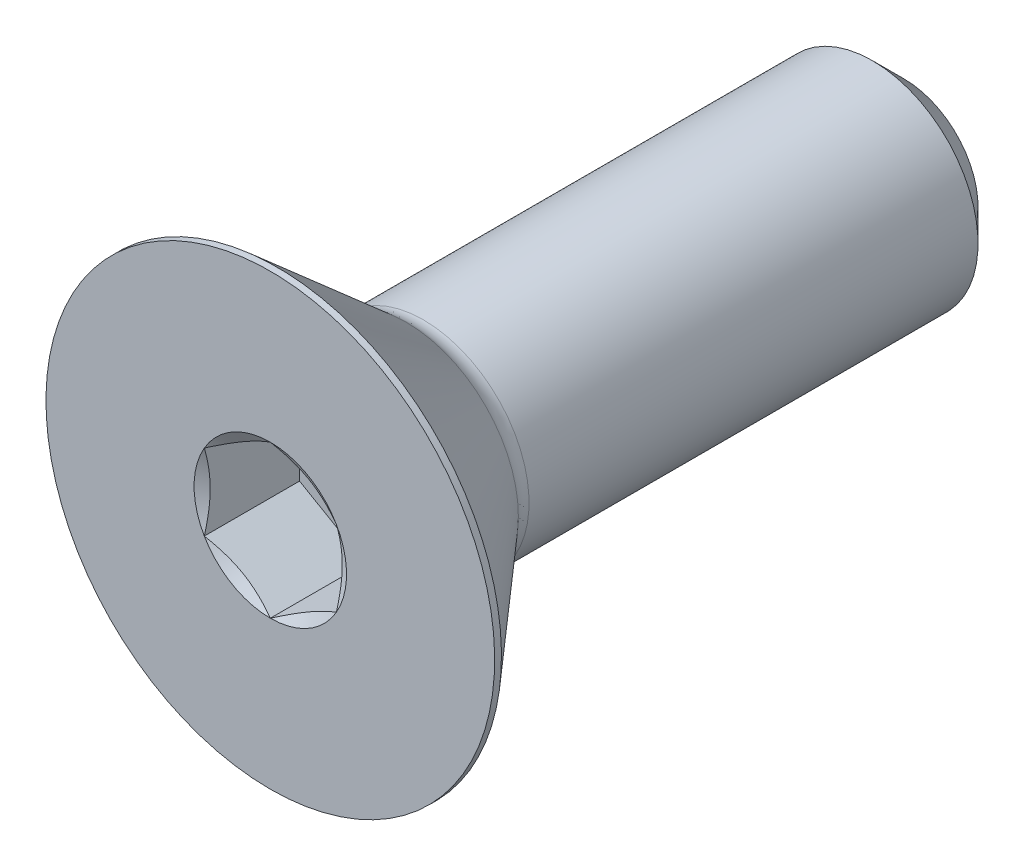
ISO-10303-21;
HEADER;
FILE_DESCRIPTION(('STEP AP214'),'2;1');
FILE_NAME('part.step','',(''),(''),'','','');
FILE_SCHEMA(('AUTOMOTIVE_DESIGN { 1 0 10303 214 1 1 1 1 }'));
ENDSEC;
DATA;
#1=APPLICATION_CONTEXT('core data for automotive mechanical design processes');
#2=APPLICATION_PROTOCOL_DEFINITION('international standard','automotive_design',2000,#1);
#3=PRODUCT_CONTEXT('',#1,'mechanical');
#4=PRODUCT('Part','Part','',(#3));
#5=PRODUCT_RELATED_PRODUCT_CATEGORY('part','',(#4));
#6=PRODUCT_DEFINITION_FORMATION('','',#4);
#7=PRODUCT_DEFINITION_CONTEXT('part definition',#1,'design');
#8=PRODUCT_DEFINITION('design','',#6,#7);
#9=PRODUCT_DEFINITION_SHAPE('','',#8);
#10=(LENGTH_UNIT() NAMED_UNIT(*) SI_UNIT(.MILLI.,.METRE.));
#11=(NAMED_UNIT(*) PLANE_ANGLE_UNIT() SI_UNIT($,.RADIAN.));
#12=(NAMED_UNIT(*) SI_UNIT($,.STERADIAN.) SOLID_ANGLE_UNIT());
#13=UNCERTAINTY_MEASURE_WITH_UNIT(LENGTH_MEASURE(1.E-05),#10,'distance_accuracy_value','');
#14=(GEOMETRIC_REPRESENTATION_CONTEXT(3) GLOBAL_UNCERTAINTY_ASSIGNED_CONTEXT((#13)) GLOBAL_UNIT_ASSIGNED_CONTEXT((#10,
#11,#12)) REPRESENTATION_CONTEXT('',''));
#15=CARTESIAN_POINT('',(0.,0.,0.));
#16=DIRECTION('',(0.,0.,1.));
#17=DIRECTION('',(1.,0.,0.));
#18=AXIS2_PLACEMENT_3D('',#15,#16,#17);
#19=CARTESIAN_POINT('',(0.,0.,-19.05));
#20=DIRECTION('',(0.,0.,-1.));
#21=DIRECTION('',(0.,1.,0.));
#22=AXIS2_PLACEMENT_3D('',#19,#20,#21);
#23=CYLINDRICAL_SURFACE('',#22,3.175);
#24=CARTESIAN_POINT('',(0.,0.,-18.0975));
#25=DIRECTION('',(0.,0.,-1.));
#26=DIRECTION('',(0.,1.,0.));
#27=AXIS2_PLACEMENT_3D('',#24,#25,#26);
#28=CIRCLE('',#27,3.175);
#29=CARTESIAN_POINT('',(0.,3.175,-18.0975));
#30=VERTEX_POINT('',#29);
#31=EDGE_CURVE('E52',#30,#30,#28,.F.);
#32=ORIENTED_EDGE('',*,*,#31,.T.);
#33=EDGE_LOOP('',(#32));
#34=FACE_BOUND('',#33,.T.);
#35=CARTESIAN_POINT('',(0.,0.,-4.60180899712602));
#36=DIRECTION('',(0.,0.,1.));
#37=DIRECTION('',(0.,-1.,0.));
#38=AXIS2_PLACEMENT_3D('',#35,#36,#37);
#39=CIRCLE('',#38,3.175);
#40=CARTESIAN_POINT('',(0.,-3.175,-4.60180899712602));
#41=VERTEX_POINT('',#40);
#42=EDGE_CURVE('E215',#41,#41,#39,.T.);
#43=ORIENTED_EDGE('',*,*,#42,.F.);
#44=EDGE_LOOP('',(#43));
#45=FACE_BOUND('',#44,.T.);
#46=ADVANCED_FACE('F38',(#34,#45),#23,.T.);
#47=CARTESIAN_POINT('',(0.,-3.175,-19.05));
#48=DIRECTION('',(0.,0.,-1.));
#49=DIRECTION('',(0.,1.,0.));
#50=AXIS2_PLACEMENT_3D('',#47,#48,#49);
#51=PLANE('',#50);
#52=CARTESIAN_POINT('',(0.,0.,-19.05));
#53=DIRECTION('',(0.,0.,-1.));
#54=DIRECTION('',(0.,1.,0.));
#55=AXIS2_PLACEMENT_3D('',#52,#53,#54);
#56=CIRCLE('',#55,2.2225);
#57=CARTESIAN_POINT('',(0.,2.2225,-19.05));
#58=VERTEX_POINT('',#57);
#59=EDGE_CURVE('E218',#58,#58,#56,.T.);
#60=ORIENTED_EDGE('',*,*,#59,.T.);
#61=EDGE_LOOP('',(#60));
#62=FACE_BOUND('',#61,.T.);
#63=ADVANCED_FACE('F228',(#62),#51,.T.);
#64=CARTESIAN_POINT('',(0.,0.,-19.05));
#65=DIRECTION('',(0.,0.,1.));
#66=DIRECTION('',(0.,-1.,0.));
#67=AXIS2_PLACEMENT_3D('',#64,#65,#66);
#68=CONICAL_SURFACE('',#67,2.2225,0.785398163397445);
#69=ORIENTED_EDGE('',*,*,#31,.F.);
#70=EDGE_LOOP('',(#69));
#71=FACE_BOUND('',#70,.T.);
#72=ORIENTED_EDGE('',*,*,#59,.F.);
#73=EDGE_LOOP('',(#72));
#74=FACE_BOUND('',#73,.T.);
#75=ADVANCED_FACE('F40',(#71,#74),#68,.T.);
#76=CARTESIAN_POINT('',(0.,0.,-4.60180899712602));
#77=DIRECTION('',(0.,0.,1.));
#78=DIRECTION('',(0.,-1.,0.));
#79=AXIS2_PLACEMENT_3D('',#76,#77,#78);
#80=TOROIDAL_SURFACE('',#79,3.95604099552517,0.781040995525163);
#81=CARTESIAN_POINT('',(0.,0.,-4.0894));
#82=DIRECTION('',(0.,0.,1.));
#83=DIRECTION('',(0.,-1.,0.));
#84=AXIS2_PLACEMENT_3D('',#81,#82,#83);
#85=CIRCLE('',#84,3.36658187365559);
#86=CARTESIAN_POINT('',(0.,-3.36658187365559,-4.0894));
#87=VERTEX_POINT('',#86);
#88=EDGE_CURVE('E212',#87,#87,#85,.T.);
#89=ORIENTED_EDGE('',*,*,#88,.F.);
#90=EDGE_LOOP('',(#89));
#91=FACE_BOUND('',#90,.T.);
#92=ORIENTED_EDGE('',*,*,#42,.T.);
#93=EDGE_LOOP('',(#92));
#94=FACE_BOUND('',#93,.T.);
#95=ADVANCED_FACE('F227',(#91,#94),#80,.F.);
#96=CARTESIAN_POINT('',(0.,0.,-4.0894));
#97=DIRECTION('',(0.,0.,1.));
#98=DIRECTION('',(0.,-1.,0.));
#99=AXIS2_PLACEMENT_3D('',#96,#97,#98);
#100=CONICAL_SURFACE('',#99,3.36658187365559,0.715584993317677);
#101=CARTESIAN_POINT('',(0.,0.,-0.204469999999999));
#102=DIRECTION('',(0.,0.,1.));
#103=DIRECTION('',(0.,-1.,0.));
#104=AXIS2_PLACEMENT_3D('',#101,#102,#103);
#105=CIRCLE('',#104,6.7437);
#106=CARTESIAN_POINT('',(0.,-6.7437,-0.204469999999999));
#107=VERTEX_POINT('',#106);
#108=EDGE_CURVE('E209',#107,#107,#105,.T.);
#109=ORIENTED_EDGE('',*,*,#108,.F.);
#110=EDGE_LOOP('',(#109));
#111=FACE_BOUND('',#110,.T.);
#112=ORIENTED_EDGE('',*,*,#88,.T.);
#113=EDGE_LOOP('',(#112));
#114=FACE_BOUND('',#113,.T.);
#115=ADVANCED_FACE('F240',(#111,#114),#100,.T.);
#116=CARTESIAN_POINT('',(0.,0.,0.));
#117=DIRECTION('',(0.,0.,1.));
#118=DIRECTION('',(0.,-1.,0.));
#119=AXIS2_PLACEMENT_3D('',#116,#117,#118);
#120=CYLINDRICAL_SURFACE('',#119,6.7437);
#121=CARTESIAN_POINT('',(0.,0.,0.));
#122=DIRECTION('',(0.,0.,1.));
#123=DIRECTION('',(0.,-1.,0.));
#124=AXIS2_PLACEMENT_3D('',#121,#122,#123);
#125=CIRCLE('',#124,6.7437);
#126=CARTESIAN_POINT('',(0.,-6.7437,0.));
#127=VERTEX_POINT('',#126);
#128=EDGE_CURVE('E197',#127,#127,#125,.T.);
#129=ORIENTED_EDGE('',*,*,#128,.F.);
#130=EDGE_LOOP('',(#129));
#131=FACE_BOUND('',#130,.T.);
#132=ORIENTED_EDGE('',*,*,#108,.T.);
#133=EDGE_LOOP('',(#132));
#134=FACE_BOUND('',#133,.T.);
#135=ADVANCED_FACE('F170',(#131,#134),#120,.T.);
#136=CARTESIAN_POINT('',(0.,-3.175,0.));
#137=DIRECTION('',(0.,0.,1.));
#138=DIRECTION('',(0.,-1.,0.));
#139=AXIS2_PLACEMENT_3D('',#136,#137,#138);
#140=PLANE('',#139);
#141=CARTESIAN_POINT('',(0.,0.,0.));
#142=DIRECTION('',(0.,0.,1.));
#143=DIRECTION('',(1.,0.,0.));
#144=AXIS2_PLACEMENT_3D('',#141,#142,#143);
#145=CIRCLE('',#144,2.29135888084633);
#146=CARTESIAN_POINT('',(0.,-2.29135888084633,0.));
#147=VERTEX_POINT('',#146);
#148=CARTESIAN_POINT('',(1.984375,-1.14567944042316,0.));
#149=VERTEX_POINT('',#148);
#150=EDGE_CURVE('E65',#147,#149,#145,.T.);
#151=ORIENTED_EDGE('',*,*,#150,.F.);
#152=CARTESIAN_POINT('',(-1.984375,-1.14567944042316,0.));
#153=VERTEX_POINT('',#152);
#154=EDGE_CURVE('E137',#153,#147,#145,.T.);
#155=ORIENTED_EDGE('',*,*,#154,.F.);
#156=CARTESIAN_POINT('',(-1.984375,1.14567944042317,0.));
#157=VERTEX_POINT('',#156);
#158=EDGE_CURVE('E136',#157,#153,#145,.T.);
#159=ORIENTED_EDGE('',*,*,#158,.F.);
#160=CARTESIAN_POINT('',(0.,2.29135888084633,0.));
#161=VERTEX_POINT('',#160);
#162=EDGE_CURVE('E106',#161,#157,#145,.T.);
#163=ORIENTED_EDGE('',*,*,#162,.F.);
#164=CARTESIAN_POINT('',(1.984375,1.14567944042316,0.));
#165=VERTEX_POINT('',#164);
#166=EDGE_CURVE('E97',#165,#161,#145,.T.);
#167=ORIENTED_EDGE('',*,*,#166,.F.);
#168=EDGE_CURVE('E58',#149,#165,#145,.T.);
#169=ORIENTED_EDGE('',*,*,#168,.F.);
#170=EDGE_LOOP('',(#151,#155,#159,#163,#167,#169));
#171=FACE_BOUND('',#170,.T.);
#172=ORIENTED_EDGE('',*,*,#128,.T.);
#173=EDGE_LOOP('',(#172));
#174=FACE_BOUND('',#173,.T.);
#175=ADVANCED_FACE('F132',(#171,#174),#140,.T.);
#176=CARTESIAN_POINT('',(0.,0.,0.));
#177=DIRECTION('',(0.,0.,1.));
#178=DIRECTION('',(1.,0.,0.));
#179=AXIS2_PLACEMENT_3D('',#176,#177,#178);
#180=CONICAL_SURFACE('',#179,2.29135888084633,1.0471975511966);
#181=ORIENTED_EDGE('',*,*,#162,.T.);
#182=CARTESIAN_POINT('',(0.000199999999999609,2.29147435090017,6.66717057831416E-05));
#183=CARTESIAN_POINT('',(-0.0870046387806768,2.24112672922556,-0.029014317759813));
#184=CARTESIAN_POINT('',(-0.174962019304997,2.19034451190263,-0.0554627919729485));
#185=CARTESIAN_POINT('',(-0.35239997867232,2.08790065829745,-0.101629728793529));
#186=CARTESIAN_POINT('',(-0.441883711256319,2.03623720120198,-0.121331857751036));
#187=CARTESIAN_POINT('',(-0.619742148012469,1.93355058486317,-0.152002268068471));
#188=CARTESIAN_POINT('',(-0.708089480306094,1.88254322878126,-0.163174657279787));
#189=CARTESIAN_POINT('',(-0.88520002811095,1.78028840632981,-0.176514203945575));
#190=CARTESIAN_POINT('',(-0.973962599510547,1.72904131183829,-0.178692405539878));
#191=CARTESIAN_POINT('',(-1.13983230286466,1.63327639395638,-0.174170448491651));
#192=CARTESIAN_POINT('',(-1.21696421566591,1.58874426333747,-0.168580586544127));
#193=CARTESIAN_POINT('',(-1.37072550718908,1.49997014028563,-0.150861066102989));
#194=CARTESIAN_POINT('',(-1.44735435374552,1.45572845509857,-0.138725349670475));
#195=CARTESIAN_POINT('',(-1.60143288850678,1.36677117157782,-0.108385841155635));
#196=CARTESIAN_POINT('',(-1.67886306721268,1.32206683705857,-0.09005339070901));
#197=CARTESIAN_POINT('',(-1.83256831124359,1.23332507304146,-0.0484454935998176));
#198=CARTESIAN_POINT('',(-1.90884534705293,1.18928650588395,-0.0251798287176209));
#199=CARTESIAN_POINT('',(-1.984575,1.14556397036933,6.66717057829762E-05));
#200=B_SPLINE_CURVE_WITH_KNOTS('',3,(#182,#183,#184,#185,#186,#187,#188,#189,#190,#191,#192,
#193,#194,#195,#196,#197,#198,#199),.UNSPECIFIED.,.F.,.F.,(4,2,2,2,2,2,2,2,4),(0.,
0.314555137114086,0.629866549668806,0.937373439505933,1.24450262309398,1.51196650590478,
1.77967834211415,2.05332989762155,2.32644383656793),.UNSPECIFIED.);
#201=EDGE_CURVE('E11',#161,#157,#200,.T.);
#202=ORIENTED_EDGE('',*,*,#201,.F.);
#203=EDGE_LOOP('',(#181,#202));
#204=FACE_BOUND('',#203,.T.);
#205=ADVANCED_FACE('F110',(#204),#180,.F.);
#206=ORIENTED_EDGE('',*,*,#158,.T.);
#207=CARTESIAN_POINT('',(-1.984375,-2.96692860034507,0.737860651092377));
#208=CARTESIAN_POINT('',(-1.984375,-2.88123645369667,0.69674880177529));
#209=CARTESIAN_POINT('',(-1.984375,-2.79533554929687,0.656063972956056));
#210=CARTESIAN_POINT('',(-1.984375,-2.62300496253372,0.575790597945192));
#211=CARTESIAN_POINT('',(-1.984375,-2.53657518838115,0.536202249047077));
#212=CARTESIAN_POINT('',(-1.984375,-2.36258003650985,0.458142914429596));
#213=CARTESIAN_POINT('',(-1.984375,-2.27501095051754,0.419680163398946));
#214=CARTESIAN_POINT('',(-1.984375,-2.09913795632987,0.344479427097519));
#215=CARTESIAN_POINT('',(-1.984375,-2.01083408662377,0.307741352146445));
#216=CARTESIAN_POINT('',(-1.984375,-1.83102497893539,0.235513729354963));
#217=CARTESIAN_POINT('',(-1.984375,-1.73949640320228,0.200081939073892));
#218=CARTESIAN_POINT('',(-1.984375,-1.55533214713673,0.132164183556778));
#219=CARTESIAN_POINT('',(-1.984375,-1.46269633980312,0.0996785599926462));
#220=CARTESIAN_POINT('',(-1.984375,-1.27638419434466,0.0385821363592113));
#221=CARTESIAN_POINT('',(-1.984375,-1.18271082678456,0.00996237523819853));
#222=CARTESIAN_POINT('',(-1.984375,-0.994021652382587,-0.0424236311394211));
#223=CARTESIAN_POINT('',(-1.984375,-0.899006185229732,-0.0661910818015453));
#224=CARTESIAN_POINT('',(-1.984375,-0.70783051245842,-0.107605260619429));
#225=CARTESIAN_POINT('',(-1.984375,-0.611673084373239,-0.125264559933971));
#226=CARTESIAN_POINT('',(-1.984375,-0.418283092113672,-0.153306903466505));
#227=CARTESIAN_POINT('',(-1.984375,-0.32105060104525,-0.163690439394072));
#228=CARTESIAN_POINT('',(-1.984375,-0.127210752774483,-0.176214799009401));
#229=CARTESIAN_POINT('',(-1.984375,-0.0306098639781231,-0.178452892631436));
#230=CARTESIAN_POINT('',(-1.984375,0.162431915887106,-0.17475795296783));
#231=CARTESIAN_POINT('',(-1.984375,0.258872796678698,-0.168824413724938));
#232=CARTESIAN_POINT('',(-1.984375,0.496826477184735,-0.144624426308478));
#233=CARTESIAN_POINT('',(-1.984375,0.637878211825128,-0.121822779785831));
#234=CARTESIAN_POINT('',(-1.984375,0.91723870370253,-0.0630239757386336));
#235=CARTESIAN_POINT('',(-1.984375,1.05554394232965,-0.0270109144574765));
#236=CARTESIAN_POINT('',(-1.984375,1.26239464896717,0.0345082078903479));
#237=CARTESIAN_POINT('',(-1.984375,1.33200934564274,0.0565514264145546));
#238=CARTESIAN_POINT('',(-1.984375,1.47051409380588,0.102676986257499));
#239=CARTESIAN_POINT('',(-1.984375,1.53940456776433,0.126758055006123));
#240=CARTESIAN_POINT('',(-1.984375,1.67655293465251,0.176609588689456));
#241=CARTESIAN_POINT('',(-1.984375,1.74481093998431,0.202379746602285));
#242=CARTESIAN_POINT('',(-1.984375,1.88078910071683,0.255330712681564));
#243=CARTESIAN_POINT('',(-1.984375,1.94850916300286,0.282511759182964));
#244=CARTESIAN_POINT('',(-1.984375,2.12136731788458,0.353633623835928));
#245=CARTESIAN_POINT('',(-1.984375,2.22615977384556,0.398413596701326));
#246=CARTESIAN_POINT('',(-1.984375,2.43479837304527,0.490132195682473));
#247=CARTESIAN_POINT('',(-1.984375,2.5386444446916,0.537070983511256));
#248=CARTESIAN_POINT('',(-1.984375,2.84907841644385,0.680364561323518));
#249=CARTESIAN_POINT('',(-1.984375,3.05452739791262,0.77918187526435));
#250=CARTESIAN_POINT('',(-1.984375,3.46367014223902,0.980960885724764));
#251=CARTESIAN_POINT('',(-1.984375,3.66736143684958,1.08392752775299));
#252=CARTESIAN_POINT('',(-1.984375,4.07334844866211,1.29250841655482));
#253=CARTESIAN_POINT('',(-1.984375,4.27564433912763,1.39812232679349));
#254=CARTESIAN_POINT('',(-1.984375,4.66022184962415,1.60111933686162));
#255=CARTESIAN_POINT('',(-1.984375,4.84259034249047,1.69833842729249));
#256=CARTESIAN_POINT('',(-1.984375,5.20674070245669,1.89388432048827));
#257=CARTESIAN_POINT('',(-1.984375,5.38852254752481,1.99221116424656));
#258=CARTESIAN_POINT('',(-1.984375,5.75117247931181,2.18944361750704));
#259=CARTESIAN_POINT('',(-1.984375,5.93204171415673,2.2883471187779));
#260=CARTESIAN_POINT('',(-1.984375,6.29341450955436,2.48679783989033));
#261=CARTESIAN_POINT('',(-1.984375,6.47391808874828,2.5863450257738));
#262=CARTESIAN_POINT('',(-1.984375,6.6542902961452,2.6861282522634));
#263=B_SPLINE_CURVE_WITH_KNOTS('',3,(#207,#208,#209,#210,#211,#212,#213,#214,#215,#216,#217,
#218,#219,#220,#221,#222,#223,#224,#225,#226,#227,#228,#229,#230,#231,#232,#233,#234,#235,#236,
#237,#238,#239,#240,#241,#242,#243,#244,#245,#246,#247,#248,#249,#250,#251,#252,#253,#254,#255,
#256,#257,#258,#259,#260,#261,#262),.UNSPECIFIED.,.F.,.F.,(4,2,2,2,2,2,2,2,2,2,2,2,2,2,2,2,2,2,
2,2,2,2,2,2,2,2,2,4),(0.,0.285135519832373,0.570322016122788,0.857238463819792,1.14413997577449,
1.43854271801315,1.7329795590899,2.02672173491208,2.32039085060263,2.61345191984504,
2.90649318156653,3.19602335108128,3.48557144803805,3.91334047285799,4.34162614021154,
4.56066589824458,4.77956986852721,4.99843415889189,5.21733554208811,5.55917796423187,
5.90104603503021,6.58489509249957,7.26958483186157,7.95418796687477,8.57417425374278,
9.1941835596094,9.81261585701217,10.431015790458),.UNSPECIFIED.);
#264=EDGE_CURVE('E105',#157,#153,#263,.F.);
#265=ORIENTED_EDGE('',*,*,#264,.F.);
#266=EDGE_LOOP('',(#206,#265));
#267=FACE_BOUND('',#266,.T.);
#268=ADVANCED_FACE('F268',(#267),#180,.F.);
#269=ORIENTED_EDGE('',*,*,#154,.T.);
#270=CARTESIAN_POINT('',(-1.984575,-1.14556397036933,6.66717057829649E-05));
#271=CARTESIAN_POINT('',(-1.89737036121932,-1.19591159204393,-0.0290143177598132));
#272=CARTESIAN_POINT('',(-1.809412980695,-1.24669380936686,-0.0554627919729487));
#273=CARTESIAN_POINT('',(-1.63197502132768,-1.34913766297205,-0.101629728793529));
#274=CARTESIAN_POINT('',(-1.54249128874368,-1.40080112006751,-0.121331857751037));
#275=CARTESIAN_POINT('',(-1.36463285198753,-1.50348773640632,-0.152002268068471));
#276=CARTESIAN_POINT('',(-1.27628551969391,-1.55449509248823,-0.163174657279787));
#277=CARTESIAN_POINT('',(-1.09917497188905,-1.65674991493968,-0.176514203945575));
#278=CARTESIAN_POINT('',(-1.01041240048945,-1.70799700943121,-0.178692405539878));
#279=CARTESIAN_POINT('',(-0.844542697135338,-1.80376192731311,-0.174170448491652));
#280=CARTESIAN_POINT('',(-0.767410784334093,-1.84829405793202,-0.168580586544128));
#281=CARTESIAN_POINT('',(-0.613649492810919,-1.93706818098387,-0.150861066102989));
#282=CARTESIAN_POINT('',(-0.537020646254476,-1.98130986617092,-0.138725349670476));
#283=CARTESIAN_POINT('',(-0.382942111493217,-2.07026714969167,-0.108385841155636));
#284=CARTESIAN_POINT('',(-0.305511932787318,-2.11497148421093,-0.0900533907090107));
#285=CARTESIAN_POINT('',(-0.151806688756412,-2.20371324822803,-0.0484454935998183));
#286=CARTESIAN_POINT('',(-0.075529652947068,-2.24775181538554,-0.0251798287176216));
#287=CARTESIAN_POINT('',(0.000199999999999772,-2.29147435090016,6.66717057822253E-05));
#288=B_SPLINE_CURVE_WITH_KNOTS('',3,(#270,#271,#272,#273,#274,#275,#276,#277,#278,#279,#280,
#281,#282,#283,#284,#285,#286,#287),.UNSPECIFIED.,.F.,.F.,(4,2,2,2,2,2,2,2,4),(0.,
0.314555137114086,0.629866549668806,0.937373439505932,1.24450262309398,1.51196650590478,
1.77967834211415,2.05332989762155,2.32644383656793),.UNSPECIFIED.);
#289=EDGE_CURVE('E146',#153,#147,#288,.T.);
#290=ORIENTED_EDGE('',*,*,#289,.F.);
#291=EDGE_LOOP('',(#269,#290));
#292=FACE_BOUND('',#291,.T.);
#293=ADVANCED_FACE('F274',(#292),#180,.F.);
#294=ORIENTED_EDGE('',*,*,#150,.T.);
#295=CARTESIAN_POINT('',(-0.000200000000000051,-2.29147435090016,6.66717057826408E-05));
#296=CARTESIAN_POINT('',(0.0870046387806763,-2.24112672922556,-0.0290143177598132));
#297=CARTESIAN_POINT('',(0.174962019304996,-2.19034451190263,-0.0554627919729487));
#298=CARTESIAN_POINT('',(0.352399978672319,-2.08790065829744,-0.101629728793529));
#299=CARTESIAN_POINT('',(0.441883711256319,-2.03623720120198,-0.121331857751037));
#300=CARTESIAN_POINT('',(0.619742148012468,-1.93355058486317,-0.152002268068471));
#301=CARTESIAN_POINT('',(0.708089480306093,-1.88254322878126,-0.163174657279787));
#302=CARTESIAN_POINT('',(0.885200028110949,-1.78028840632981,-0.176514203945575));
#303=CARTESIAN_POINT('',(0.973962599510546,-1.72904131183829,-0.178692405539878));
#304=CARTESIAN_POINT('',(1.13983230286466,-1.63327639395638,-0.174170448491652));
#305=CARTESIAN_POINT('',(1.21696421566591,-1.58874426333747,-0.168580586544128));
#306=CARTESIAN_POINT('',(1.37072550718908,-1.49997014028563,-0.150861066102989));
#307=CARTESIAN_POINT('',(1.44735435374552,-1.45572845509857,-0.138725349670476));
#308=CARTESIAN_POINT('',(1.60143288850678,-1.36677117157782,-0.108385841155636));
#309=CARTESIAN_POINT('',(1.67886306721268,-1.32206683705856,-0.0900533907090105));
#310=CARTESIAN_POINT('',(1.83256831124359,-1.23332507304146,-0.0484454935998179));
#311=CARTESIAN_POINT('',(1.90884534705293,-1.18928650588395,-0.0251798287176211));
#312=CARTESIAN_POINT('',(1.984575,-1.14556397036933,6.66717057827258E-05));
#313=B_SPLINE_CURVE_WITH_KNOTS('',3,(#295,#296,#297,#298,#299,#300,#301,#302,#303,#304,#305,
#306,#307,#308,#309,#310,#311,#312),.UNSPECIFIED.,.F.,.F.,(4,2,2,2,2,2,2,2,4),(0.,
0.314555137114085,0.629866549668806,0.937373439505932,1.24450262309398,1.51196650590478,
1.77967834211415,2.05332989762155,2.32644383656793),.UNSPECIFIED.);
#314=EDGE_CURVE('E397',#147,#149,#313,.T.);
#315=ORIENTED_EDGE('',*,*,#314,.F.);
#316=EDGE_LOOP('',(#294,#315));
#317=FACE_BOUND('',#316,.T.);
#318=ADVANCED_FACE('F281',(#317),#180,.F.);
#319=ORIENTED_EDGE('',*,*,#168,.T.);
#320=CARTESIAN_POINT('',(1.984375,-2.96692860034507,0.737860651092378));
#321=CARTESIAN_POINT('',(1.984375,-2.88123645369666,0.69674880177529));
#322=CARTESIAN_POINT('',(1.984375,-2.79533554929687,0.656063972956056));
#323=CARTESIAN_POINT('',(1.984375,-2.62300496253372,0.575790597945192));
#324=CARTESIAN_POINT('',(1.984375,-2.53657518838115,0.536202249047077));
#325=CARTESIAN_POINT('',(1.984375,-2.36258003650985,0.458142914429596));
#326=CARTESIAN_POINT('',(1.984375,-2.27501095051754,0.419680163398946));
#327=CARTESIAN_POINT('',(1.984375,-2.09913795632987,0.344479427097519));
#328=CARTESIAN_POINT('',(1.984375,-2.01083408662377,0.307741352146445));
#329=CARTESIAN_POINT('',(1.984375,-1.83102497893539,0.235513729354964));
#330=CARTESIAN_POINT('',(1.984375,-1.73949640320228,0.200081939073892));
#331=CARTESIAN_POINT('',(1.984375,-1.55533214713673,0.132164183556778));
#332=CARTESIAN_POINT('',(1.984375,-1.46269633980312,0.0996785599926464));
#333=CARTESIAN_POINT('',(1.984375,-1.27638419434466,0.0385821363592116));
#334=CARTESIAN_POINT('',(1.984375,-1.18271082678456,0.00996237523819882));
#335=CARTESIAN_POINT('',(1.984375,-0.994021652382587,-0.042423631139421));
#336=CARTESIAN_POINT('',(1.984375,-0.899006185229731,-0.0661910818015453));
#337=CARTESIAN_POINT('',(1.984375,-0.70783051245842,-0.107605260619429));
#338=CARTESIAN_POINT('',(1.984375,-0.611673084373239,-0.125264559933971));
#339=CARTESIAN_POINT('',(1.984375,-0.418283092113671,-0.153306903466505));
#340=CARTESIAN_POINT('',(1.984375,-0.32105060104525,-0.163690439394072));
#341=CARTESIAN_POINT('',(1.984375,-0.127210752774482,-0.176214799009401));
#342=CARTESIAN_POINT('',(1.984375,-0.0306098639781227,-0.178452892631436));
#343=CARTESIAN_POINT('',(1.984375,0.162431915887107,-0.17475795296783));
#344=CARTESIAN_POINT('',(1.984375,0.258872796678699,-0.168824413724938));
#345=CARTESIAN_POINT('',(1.984375,0.496826477184735,-0.144624426308478));
#346=CARTESIAN_POINT('',(1.984375,0.637878211825129,-0.12182277978583));
#347=CARTESIAN_POINT('',(1.984375,0.91723870370253,-0.0630239757386333));
#348=CARTESIAN_POINT('',(1.984375,1.05554394232965,-0.0270109144574763));
#349=CARTESIAN_POINT('',(1.984375,1.26239464896717,0.0345082078903483));
#350=CARTESIAN_POINT('',(1.984375,1.33200934564274,0.0565514264145553));
#351=CARTESIAN_POINT('',(1.984375,1.47051409380588,0.1026769862575));
#352=CARTESIAN_POINT('',(1.984375,1.53940456776433,0.126758055006124));
#353=CARTESIAN_POINT('',(1.984375,1.67655293465251,0.176609588689457));
#354=CARTESIAN_POINT('',(1.984375,1.74481093998432,0.202379746602286));
#355=CARTESIAN_POINT('',(1.984375,1.88078910071683,0.255330712681565));
#356=CARTESIAN_POINT('',(1.984375,1.94850916300287,0.282511759182965));
#357=CARTESIAN_POINT('',(1.984375,2.12136731788458,0.353633623835929));
#358=CARTESIAN_POINT('',(1.984375,2.22615977384557,0.398413596701327));
#359=CARTESIAN_POINT('',(1.984375,2.43479837304527,0.490132195682473));
#360=CARTESIAN_POINT('',(1.984375,2.5386444446916,0.537070983511257));
#361=CARTESIAN_POINT('',(1.984375,2.84907841644385,0.680364561323519));
#362=CARTESIAN_POINT('',(1.984375,3.05452739791262,0.779181875264351));
#363=CARTESIAN_POINT('',(1.984375,3.46367014223902,0.980960885724765));
#364=CARTESIAN_POINT('',(1.984375,3.66736143684958,1.08392752775299));
#365=CARTESIAN_POINT('',(1.984375,4.07334844866211,1.29250841655482));
#366=CARTESIAN_POINT('',(1.984375,4.27564433912763,1.3981223267935));
#367=CARTESIAN_POINT('',(1.984375,4.66022184962416,1.60111933686162));
#368=CARTESIAN_POINT('',(1.984375,4.84259034249048,1.6983384272925));
#369=CARTESIAN_POINT('',(1.984375,5.2067407024567,1.89388432048827));
#370=CARTESIAN_POINT('',(1.984375,5.38852254752481,1.99221116424656));
#371=CARTESIAN_POINT('',(1.984375,5.75117247931181,2.18944361750704));
#372=CARTESIAN_POINT('',(1.984375,5.93204171415673,2.2883471187779));
#373=CARTESIAN_POINT('',(1.984375,6.29341450955436,2.48679783989034));
#374=CARTESIAN_POINT('',(1.984375,6.47391808874828,2.5863450257738));
#375=CARTESIAN_POINT('',(1.984375,6.6542902961452,2.6861282522634));
#376=B_SPLINE_CURVE_WITH_KNOTS('',3,(#320,#321,#322,#323,#324,#325,#326,#327,#328,#329,#330,
#331,#332,#333,#334,#335,#336,#337,#338,#339,#340,#341,#342,#343,#344,#345,#346,#347,#348,#349,
#350,#351,#352,#353,#354,#355,#356,#357,#358,#359,#360,#361,#362,#363,#364,#365,#366,#367,#368,
#369,#370,#371,#372,#373,#374,#375),.UNSPECIFIED.,.F.,.F.,(4,2,2,2,2,2,2,2,2,2,2,2,2,2,2,2,2,2,
2,2,2,2,2,2,2,2,2,4),(0.,0.285135519832374,0.570322016122787,0.857238463819791,1.14413997577449,
1.43854271801315,1.7329795590899,2.02672173491208,2.32039085060263,2.61345191984504,
2.90649318156653,3.19602335108128,3.48557144803805,3.91334047285799,4.34162614021154,
4.56066589824458,4.77956986852721,4.9984341588919,5.21733554208812,5.55917796423187,
5.90104603503021,6.58489509249957,7.26958483186157,7.95418796687478,8.57417425374278,
9.1941835596094,9.81261585701217,10.431015790458),.UNSPECIFIED.);
#377=EDGE_CURVE('E122',#149,#165,#376,.T.);
#378=ORIENTED_EDGE('',*,*,#377,.F.);
#379=EDGE_LOOP('',(#319,#378));
#380=FACE_BOUND('',#379,.T.);
#381=ADVANCED_FACE('F288',(#380),#180,.F.);
#382=ORIENTED_EDGE('',*,*,#166,.T.);
#383=CARTESIAN_POINT('',(1.984575,1.14556397036933,6.66717057832154E-05));
#384=CARTESIAN_POINT('',(1.89737036121932,1.19591159204393,-0.029014317759813));
#385=CARTESIAN_POINT('',(1.809412980695,1.24669380936687,-0.0554627919729485));
#386=CARTESIAN_POINT('',(1.63197502132768,1.34913766297205,-0.101629728793529));
#387=CARTESIAN_POINT('',(1.54249128874368,1.40080112006751,-0.121331857751036));
#388=CARTESIAN_POINT('',(1.36463285198753,1.50348773640632,-0.152002268068471));
#389=CARTESIAN_POINT('',(1.27628551969391,1.55449509248823,-0.163174657279786));
#390=CARTESIAN_POINT('',(1.09917497188905,1.65674991493969,-0.176514203945575));
#391=CARTESIAN_POINT('',(1.01041240048945,1.70799700943121,-0.178692405539878));
#392=CARTESIAN_POINT('',(0.844542697135338,1.80376192731311,-0.174170448491651));
#393=CARTESIAN_POINT('',(0.767410784334093,1.84829405793202,-0.168580586544127));
#394=CARTESIAN_POINT('',(0.613649492810919,1.93706818098387,-0.150861066102989));
#395=CARTESIAN_POINT('',(0.537020646254476,1.98130986617092,-0.138725349670475));
#396=CARTESIAN_POINT('',(0.382942111493217,2.07026714969167,-0.108385841155635));
#397=CARTESIAN_POINT('',(0.305511932787317,2.11497148421093,-0.0900533907090102));
#398=CARTESIAN_POINT('',(0.151806688756411,2.20371324822803,-0.0484454935998178));
#399=CARTESIAN_POINT('',(0.0755296529470672,2.24775181538554,-0.0251798287176211));
#400=CARTESIAN_POINT('',(-0.000200000000000537,2.29147435090017,6.6671705782726E-05));
#401=B_SPLINE_CURVE_WITH_KNOTS('',3,(#383,#384,#385,#386,#387,#388,#389,#390,#391,#392,#393,
#394,#395,#396,#397,#398,#399,#400),.UNSPECIFIED.,.F.,.F.,(4,2,2,2,2,2,2,2,4),(0.,
0.314555137114086,0.629866549668806,0.937373439505933,1.24450262309398,1.51196650590478,
1.77967834211415,2.05332989762155,2.32644383656793),.UNSPECIFIED.);
#402=EDGE_CURVE('E101',#165,#161,#401,.T.);
#403=ORIENTED_EDGE('',*,*,#402,.F.);
#404=EDGE_LOOP('',(#382,#403));
#405=FACE_BOUND('',#404,.T.);
#406=ADVANCED_FACE('F99',(#405),#180,.F.);
#407=CARTESIAN_POINT('',(0.,2.29135888084633,-2.86258));
#408=DIRECTION('',(0.,0.,1.));
#409=DIRECTION('',(1.,0.,0.));
#410=AXIS2_PLACEMENT_3D('',#407,#408,#409);
#411=PLANE('',#410);
#412=DIRECTION('',(-0.866025403784439,0.5,0.));
#413=VECTOR('',#412,1.);
#414=CARTESIAN_POINT('',(1.984375,1.14567944042317,-2.86258));
#415=LINE('',#414,#413);
#416=CARTESIAN_POINT('',(1.984375,1.14567944042317,-2.86258));
#417=VERTEX_POINT('',#416);
#418=CARTESIAN_POINT('',(0.,2.29135888084633,-2.86258));
#419=VERTEX_POINT('',#418);
#420=EDGE_CURVE('E121',#417,#419,#415,.T.);
#421=ORIENTED_EDGE('',*,*,#420,.T.);
#422=DIRECTION('',(-0.866025403784439,-0.5,0.));
#423=VECTOR('',#422,1.);
#424=CARTESIAN_POINT('',(0.,2.29135888084633,-2.86258));
#425=LINE('',#424,#423);
#426=CARTESIAN_POINT('',(-1.984375,1.14567944042316,-2.86258));
#427=VERTEX_POINT('',#426);
#428=EDGE_CURVE('E126',#419,#427,#425,.T.);
#429=ORIENTED_EDGE('',*,*,#428,.T.);
#430=DIRECTION('',(0.,-1.,0.));
#431=VECTOR('',#430,1.);
#432=CARTESIAN_POINT('',(-1.984375,1.14567944042316,-2.86258));
#433=LINE('',#432,#431);
#434=CARTESIAN_POINT('',(-1.984375,-1.14567944042316,-2.86258));
#435=VERTEX_POINT('',#434);
#436=EDGE_CURVE('E185',#427,#435,#433,.T.);
#437=ORIENTED_EDGE('',*,*,#436,.T.);
#438=DIRECTION('',(0.866025403784439,-0.5,0.));
#439=VECTOR('',#438,1.);
#440=CARTESIAN_POINT('',(-1.984375,-1.14567944042316,-2.86258));
#441=LINE('',#440,#439);
#442=CARTESIAN_POINT('',(0.,-2.29135888084633,-2.86258));
#443=VERTEX_POINT('',#442);
#444=EDGE_CURVE('E188',#435,#443,#441,.T.);
#445=ORIENTED_EDGE('',*,*,#444,.T.);
#446=DIRECTION('',(0.866025403784439,0.5,0.));
#447=VECTOR('',#446,1.);
#448=CARTESIAN_POINT('',(0.,-2.29135888084633,-2.86258));
#449=LINE('',#448,#447);
#450=CARTESIAN_POINT('',(1.984375,-1.14567944042316,-2.86258));
#451=VERTEX_POINT('',#450);
#452=EDGE_CURVE('E191',#443,#451,#449,.T.);
#453=ORIENTED_EDGE('',*,*,#452,.T.);
#454=DIRECTION('',(0.,1.,0.));
#455=VECTOR('',#454,1.);
#456=CARTESIAN_POINT('',(1.984375,-1.14567944042316,-2.86258));
#457=LINE('',#456,#455);
#458=EDGE_CURVE('E129',#451,#417,#457,.T.);
#459=ORIENTED_EDGE('',*,*,#458,.T.);
#460=EDGE_LOOP('',(#421,#429,#437,#445,#453,#459));
#461=FACE_BOUND('',#460,.T.);
#462=ADVANCED_FACE('F165',(#461),#411,.T.);
#463=CARTESIAN_POINT('',(0.,2.29135888084633,-2.86258));
#464=DIRECTION('',(-0.5,0.866025403784439,0.));
#465=DIRECTION('',(-0.866025403784439,-0.5,0.));
#466=AXIS2_PLACEMENT_3D('',#463,#464,#465);
#467=PLANE('',#466);
#468=DIRECTION('',(0.,0.,1.));
#469=VECTOR('',#468,1.);
#470=CARTESIAN_POINT('',(0.,2.29135888084633,-2.86258));
#471=LINE('',#470,#469);
#472=EDGE_CURVE('E118',#419,#161,#471,.T.);
#473=ORIENTED_EDGE('',*,*,#472,.T.);
#474=ORIENTED_EDGE('',*,*,#201,.T.);
#475=DIRECTION('',(0.,0.,1.));
#476=VECTOR('',#475,1.);
#477=CARTESIAN_POINT('',(-1.984375,1.14567944042316,-2.86258));
#478=LINE('',#477,#476);
#479=EDGE_CURVE('E128',#427,#157,#478,.T.);
#480=ORIENTED_EDGE('',*,*,#479,.F.);
#481=ORIENTED_EDGE('',*,*,#428,.F.);
#482=EDGE_LOOP('',(#473,#474,#480,#481));
#483=FACE_BOUND('',#482,.T.);
#484=ADVANCED_FACE('F124',(#483),#467,.F.);
#485=CARTESIAN_POINT('',(-1.984375,1.14567944042316,-2.86258));
#486=DIRECTION('',(-1.,0.,0.));
#487=DIRECTION('',(0.,-1.,0.));
#488=AXIS2_PLACEMENT_3D('',#485,#486,#487);
#489=PLANE('',#488);
#490=ORIENTED_EDGE('',*,*,#479,.T.);
#491=ORIENTED_EDGE('',*,*,#264,.T.);
#492=DIRECTION('',(0.,0.,1.));
#493=VECTOR('',#492,1.);
#494=CARTESIAN_POINT('',(-1.984375,-1.14567944042316,-2.86258));
#495=LINE('',#494,#493);
#496=EDGE_CURVE('E204',#435,#153,#495,.T.);
#497=ORIENTED_EDGE('',*,*,#496,.F.);
#498=ORIENTED_EDGE('',*,*,#436,.F.);
#499=EDGE_LOOP('',(#490,#491,#497,#498));
#500=FACE_BOUND('',#499,.T.);
#501=ADVANCED_FACE('F155',(#500),#489,.F.);
#502=CARTESIAN_POINT('',(-1.984375,-1.14567944042316,-2.86258));
#503=DIRECTION('',(-0.5,-0.866025403784439,0.));
#504=DIRECTION('',(0.866025403784439,-0.5,0.));
#505=AXIS2_PLACEMENT_3D('',#502,#503,#504);
#506=PLANE('',#505);
#507=ORIENTED_EDGE('',*,*,#496,.T.);
#508=ORIENTED_EDGE('',*,*,#289,.T.);
#509=DIRECTION('',(0.,0.,1.));
#510=VECTOR('',#509,1.);
#511=CARTESIAN_POINT('',(0.,-2.29135888084633,-2.86258));
#512=LINE('',#511,#510);
#513=EDGE_CURVE('E201',#443,#147,#512,.T.);
#514=ORIENTED_EDGE('',*,*,#513,.F.);
#515=ORIENTED_EDGE('',*,*,#444,.F.);
#516=EDGE_LOOP('',(#507,#508,#514,#515));
#517=FACE_BOUND('',#516,.T.);
#518=ADVANCED_FACE('F158',(#517),#506,.F.);
#519=CARTESIAN_POINT('',(0.,-2.29135888084633,-2.86258));
#520=DIRECTION('',(0.5,-0.866025403784439,0.));
#521=DIRECTION('',(0.866025403784439,0.5,0.));
#522=AXIS2_PLACEMENT_3D('',#519,#520,#521);
#523=PLANE('',#522);
#524=ORIENTED_EDGE('',*,*,#513,.T.);
#525=ORIENTED_EDGE('',*,*,#314,.T.);
#526=DIRECTION('',(0.,0.,1.));
#527=VECTOR('',#526,1.);
#528=CARTESIAN_POINT('',(1.984375,-1.14567944042316,-2.86258));
#529=LINE('',#528,#527);
#530=EDGE_CURVE('E198',#451,#149,#529,.T.);
#531=ORIENTED_EDGE('',*,*,#530,.F.);
#532=ORIENTED_EDGE('',*,*,#452,.F.);
#533=EDGE_LOOP('',(#524,#525,#531,#532));
#534=FACE_BOUND('',#533,.T.);
#535=ADVANCED_FACE('F317',(#534),#523,.F.);
#536=CARTESIAN_POINT('',(1.984375,-1.14567944042316,-2.86258));
#537=DIRECTION('',(1.,0.,0.));
#538=DIRECTION('',(0.,0.,-1.));
#539=AXIS2_PLACEMENT_3D('',#536,#537,#538);
#540=PLANE('',#539);
#541=ORIENTED_EDGE('',*,*,#530,.T.);
#542=ORIENTED_EDGE('',*,*,#377,.T.);
#543=DIRECTION('',(0.,0.,1.));
#544=VECTOR('',#543,1.);
#545=CARTESIAN_POINT('',(1.984375,1.14567944042317,-2.86258));
#546=LINE('',#545,#544);
#547=EDGE_CURVE('E120',#417,#165,#546,.T.);
#548=ORIENTED_EDGE('',*,*,#547,.F.);
#549=ORIENTED_EDGE('',*,*,#458,.F.);
#550=EDGE_LOOP('',(#541,#542,#548,#549));
#551=FACE_BOUND('',#550,.T.);
#552=ADVANCED_FACE('F169',(#551),#540,.F.);
#553=CARTESIAN_POINT('',(1.984375,1.14567944042317,-2.86258));
#554=DIRECTION('',(0.5,0.866025403784439,0.));
#555=DIRECTION('',(-0.866025403784439,0.5,0.));
#556=AXIS2_PLACEMENT_3D('',#553,#554,#555);
#557=PLANE('',#556);
#558=ORIENTED_EDGE('',*,*,#547,.T.);
#559=ORIENTED_EDGE('',*,*,#402,.T.);
#560=ORIENTED_EDGE('',*,*,#472,.F.);
#561=ORIENTED_EDGE('',*,*,#420,.F.);
#562=EDGE_LOOP('',(#558,#559,#560,#561));
#563=FACE_BOUND('',#562,.T.);
#564=ADVANCED_FACE('F116',(#563),#557,.F.);
#565=CLOSED_SHELL('',(#46,#63,#75,#95,#115,#135,#175,#205,#268,#293,#318,#381,#406,#462,#484,
#501,#518,#535,#552,#564));
#566=MANIFOLD_SOLID_BREP('B2',#565);
#567=ADVANCED_BREP_SHAPE_REPRESENTATION('',(#18,#566),#14);
#568=SHAPE_DEFINITION_REPRESENTATION(#9,#567);
ENDSEC;
END-ISO-10303-21;
